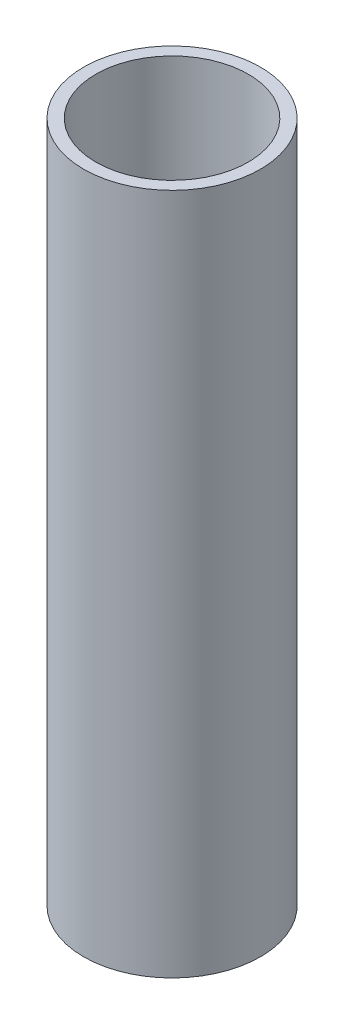
ISO-10303-21;
HEADER;
FILE_DESCRIPTION(('STEP AP214'),'2;1');
FILE_NAME('part.step','',(''),(''),'','','');
FILE_SCHEMA(('AUTOMOTIVE_DESIGN { 1 0 10303 214 1 1 1 1 }'));
ENDSEC;
DATA;
#1=APPLICATION_CONTEXT('core data for automotive mechanical design processes');
#2=APPLICATION_PROTOCOL_DEFINITION('international standard','automotive_design',2000,#1);
#3=PRODUCT_CONTEXT('',#1,'mechanical');
#4=PRODUCT('Part','Part','',(#3));
#5=PRODUCT_RELATED_PRODUCT_CATEGORY('part','',(#4));
#6=PRODUCT_DEFINITION_FORMATION('','',#4);
#7=PRODUCT_DEFINITION_CONTEXT('part definition',#1,'design');
#8=PRODUCT_DEFINITION('design','',#6,#7);
#9=PRODUCT_DEFINITION_SHAPE('','',#8);
#10=(LENGTH_UNIT() NAMED_UNIT(*) SI_UNIT(.MILLI.,.METRE.));
#11=(NAMED_UNIT(*) PLANE_ANGLE_UNIT() SI_UNIT($,.RADIAN.));
#12=(NAMED_UNIT(*) SI_UNIT($,.STERADIAN.) SOLID_ANGLE_UNIT());
#13=UNCERTAINTY_MEASURE_WITH_UNIT(LENGTH_MEASURE(1.E-05),#10,'distance_accuracy_value','');
#14=(GEOMETRIC_REPRESENTATION_CONTEXT(3) GLOBAL_UNCERTAINTY_ASSIGNED_CONTEXT((#13)) GLOBAL_UNIT_ASSIGNED_CONTEXT((#10,
#11,#12)) REPRESENTATION_CONTEXT('',''));
#15=CARTESIAN_POINT('',(0.,0.,0.));
#16=DIRECTION('',(0.,0.,1.));
#17=DIRECTION('',(1.,0.,0.));
#18=AXIS2_PLACEMENT_3D('',#15,#16,#17);
#19=CARTESIAN_POINT('',(0.,232.625,0.));
#20=DIRECTION('',(0.,1.,0.));
#21=DIRECTION('',(0.,0.,1.));
#22=AXIS2_PLACEMENT_3D('',#19,#20,#21);
#23=PLANE('',#22);
#24=CARTESIAN_POINT('',(0.,232.625,0.));
#25=DIRECTION('',(0.,1.,0.));
#26=DIRECTION('',(0.,0.,1.));
#27=AXIS2_PLACEMENT_3D('',#24,#25,#26);
#28=CIRCLE('',#27,30.1625);
#29=CARTESIAN_POINT('',(0.,232.625,30.1625));
#30=VERTEX_POINT('',#29);
#31=EDGE_CURVE('E10',#30,#30,#28,.T.);
#32=ORIENTED_EDGE('',*,*,#31,.T.);
#33=EDGE_LOOP('',(#32));
#34=FACE_BOUND('',#33,.T.);
#35=CARTESIAN_POINT('',(0.,232.625,0.));
#36=DIRECTION('',(0.,1.,0.));
#37=DIRECTION('',(0.,0.,1.));
#38=AXIS2_PLACEMENT_3D('',#35,#36,#37);
#39=CIRCLE('',#38,25.9969);
#40=CARTESIAN_POINT('',(0.,232.625,25.9969));
#41=VERTEX_POINT('',#40);
#42=EDGE_CURVE('E49',#41,#41,#39,.T.);
#43=ORIENTED_EDGE('',*,*,#42,.F.);
#44=EDGE_LOOP('',(#43));
#45=FACE_BOUND('',#44,.T.);
#46=ADVANCED_FACE('F38',(#34,#45),#23,.T.);
#47=CARTESIAN_POINT('',(0.,0.,0.));
#48=DIRECTION('',(0.,1.,0.));
#49=DIRECTION('',(0.,0.,1.));
#50=AXIS2_PLACEMENT_3D('',#47,#48,#49);
#51=PLANE('',#50);
#52=CARTESIAN_POINT('',(0.,0.,0.));
#53=DIRECTION('',(0.,1.,0.));
#54=DIRECTION('',(0.,0.,1.));
#55=AXIS2_PLACEMENT_3D('',#52,#53,#54);
#56=CIRCLE('',#55,30.1625);
#57=CARTESIAN_POINT('',(0.,0.,30.1625));
#58=VERTEX_POINT('',#57);
#59=EDGE_CURVE('E42',#58,#58,#56,.T.);
#60=ORIENTED_EDGE('',*,*,#59,.F.);
#61=EDGE_LOOP('',(#60));
#62=FACE_BOUND('',#61,.T.);
#63=CARTESIAN_POINT('',(0.,0.,0.));
#64=DIRECTION('',(0.,1.,0.));
#65=DIRECTION('',(0.,0.,1.));
#66=AXIS2_PLACEMENT_3D('',#63,#64,#65);
#67=CIRCLE('',#66,25.9969);
#68=CARTESIAN_POINT('',(0.,0.,25.9969));
#69=VERTEX_POINT('',#68);
#70=EDGE_CURVE('E51',#69,#69,#67,.T.);
#71=ORIENTED_EDGE('',*,*,#70,.T.);
#72=EDGE_LOOP('',(#71));
#73=FACE_BOUND('',#72,.T.);
#74=ADVANCED_FACE('F61',(#62,#73),#51,.F.);
#75=CARTESIAN_POINT('',(0.,232.625,0.));
#76=DIRECTION('',(0.,-1.,0.));
#77=DIRECTION('',(0.,0.,-1.));
#78=AXIS2_PLACEMENT_3D('',#75,#76,#77);
#79=CYLINDRICAL_SURFACE('',#78,30.1625);
#80=ORIENTED_EDGE('',*,*,#31,.F.);
#81=EDGE_LOOP('',(#80));
#82=FACE_BOUND('',#81,.T.);
#83=ORIENTED_EDGE('',*,*,#59,.T.);
#84=EDGE_LOOP('',(#83));
#85=FACE_BOUND('',#84,.T.);
#86=ADVANCED_FACE('F40',(#82,#85),#79,.T.);
#87=CARTESIAN_POINT('',(0.,232.625,0.));
#88=DIRECTION('',(0.,-1.,0.));
#89=DIRECTION('',(0.,0.,-1.));
#90=AXIS2_PLACEMENT_3D('',#87,#88,#89);
#91=CYLINDRICAL_SURFACE('',#90,25.9969);
#92=ORIENTED_EDGE('',*,*,#42,.T.);
#93=EDGE_LOOP('',(#92));
#94=FACE_BOUND('',#93,.T.);
#95=ORIENTED_EDGE('',*,*,#70,.F.);
#96=EDGE_LOOP('',(#95));
#97=FACE_BOUND('',#96,.T.);
#98=ADVANCED_FACE('F57',(#94,#97),#91,.F.);
#99=CLOSED_SHELL('',(#46,#74,#86,#98));
#100=MANIFOLD_SOLID_BREP('B2',#99);
#101=ADVANCED_BREP_SHAPE_REPRESENTATION('',(#18,#100),#14);
#102=SHAPE_DEFINITION_REPRESENTATION(#9,#101);
ENDSEC;
END-ISO-10303-21;
